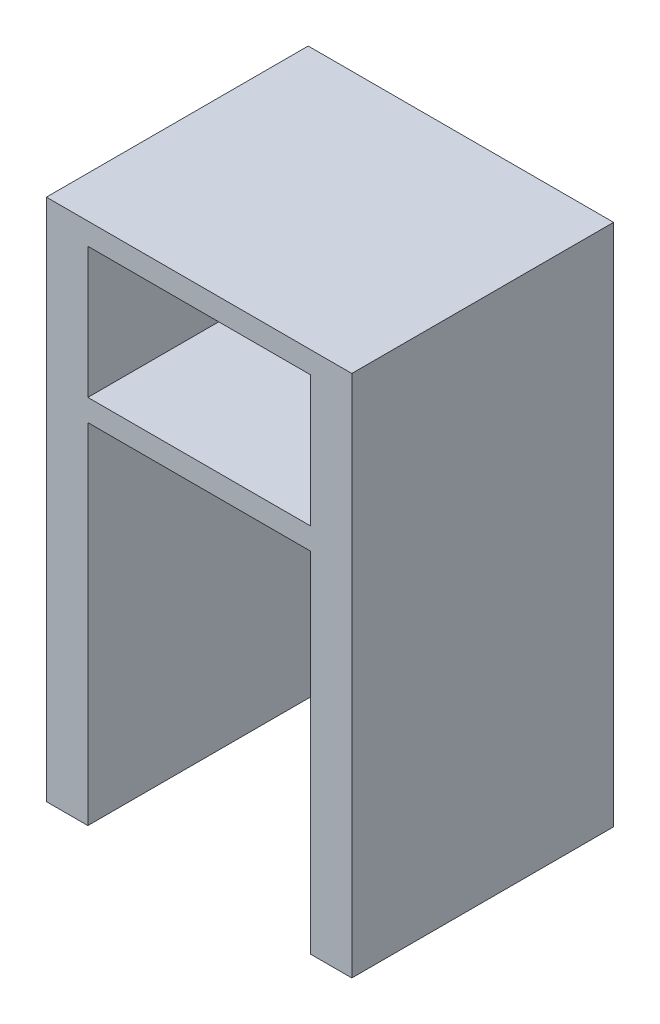
ISO-10303-21;
HEADER;
FILE_DESCRIPTION(('STEP AP214'),'2;1');
FILE_NAME('part.step','',(''),(''),'','','');
FILE_SCHEMA(('AUTOMOTIVE_DESIGN { 1 0 10303 214 1 1 1 1 }'));
ENDSEC;
DATA;
#1=APPLICATION_CONTEXT('core data for automotive mechanical design processes');
#2=APPLICATION_PROTOCOL_DEFINITION('international standard','automotive_design',2000,#1);
#3=PRODUCT_CONTEXT('',#1,'mechanical');
#4=PRODUCT('Part','Part','',(#3));
#5=PRODUCT_RELATED_PRODUCT_CATEGORY('part','',(#4));
#6=PRODUCT_DEFINITION_FORMATION('','',#4);
#7=PRODUCT_DEFINITION_CONTEXT('part definition',#1,'design');
#8=PRODUCT_DEFINITION('design','',#6,#7);
#9=PRODUCT_DEFINITION_SHAPE('','',#8);
#10=(LENGTH_UNIT() NAMED_UNIT(*) SI_UNIT(.MILLI.,.METRE.));
#11=(NAMED_UNIT(*) PLANE_ANGLE_UNIT() SI_UNIT($,.RADIAN.));
#12=(NAMED_UNIT(*) SI_UNIT($,.STERADIAN.) SOLID_ANGLE_UNIT());
#13=UNCERTAINTY_MEASURE_WITH_UNIT(LENGTH_MEASURE(1.E-05),#10,'distance_accuracy_value','');
#14=(GEOMETRIC_REPRESENTATION_CONTEXT(3) GLOBAL_UNCERTAINTY_ASSIGNED_CONTEXT((#13)) GLOBAL_UNIT_ASSIGNED_CONTEXT((#10,
#11,#12)) REPRESENTATION_CONTEXT('',''));
#15=CARTESIAN_POINT('',(0.,0.,0.));
#16=DIRECTION('',(0.,0.,1.));
#17=DIRECTION('',(1.,0.,0.));
#18=AXIS2_PLACEMENT_3D('',#15,#16,#17);
#19=CARTESIAN_POINT('',(-70.,-120.,120.));
#20=DIRECTION('',(0.,1.,0.));
#21=DIRECTION('',(0.,0.,1.));
#22=AXIS2_PLACEMENT_3D('',#19,#20,#21);
#23=PLANE('',#22);
#24=DIRECTION('',(1.,0.,0.));
#25=VECTOR('',#24,1.);
#26=CARTESIAN_POINT('',(-70.,-120.,0.));
#27=LINE('',#26,#25);
#28=CARTESIAN_POINT('',(-70.,-120.,0.));
#29=VERTEX_POINT('',#28);
#30=CARTESIAN_POINT('',(-51.,-120.,0.));
#31=VERTEX_POINT('',#30);
#32=EDGE_CURVE('E146',#29,#31,#27,.T.);
#33=ORIENTED_EDGE('',*,*,#32,.T.);
#34=DIRECTION('',(0.,0.,1.));
#35=VECTOR('',#34,1.);
#36=CARTESIAN_POINT('',(-51.,-120.,0.));
#37=LINE('',#36,#35);
#38=CARTESIAN_POINT('',(-51.,-120.,120.));
#39=VERTEX_POINT('',#38);
#40=EDGE_CURVE('E129',#31,#39,#37,.T.);
#41=ORIENTED_EDGE('',*,*,#40,.T.);
#42=DIRECTION('',(1.,0.,0.));
#43=VECTOR('',#42,1.);
#44=CARTESIAN_POINT('',(-70.,-120.,120.));
#45=LINE('',#44,#43);
#46=CARTESIAN_POINT('',(-70.,-120.,120.));
#47=VERTEX_POINT('',#46);
#48=EDGE_CURVE('E172',#47,#39,#45,.T.);
#49=ORIENTED_EDGE('',*,*,#48,.F.);
#50=DIRECTION('',(0.,0.,-1.));
#51=VECTOR('',#50,1.);
#52=CARTESIAN_POINT('',(-70.,-120.,120.));
#53=LINE('',#52,#51);
#54=EDGE_CURVE('E154',#47,#29,#53,.T.);
#55=ORIENTED_EDGE('',*,*,#54,.T.);
#56=EDGE_LOOP('',(#33,#41,#49,#55));
#57=FACE_BOUND('',#56,.T.);
#58=ADVANCED_FACE('F39',(#57),#23,.F.);
#59=CARTESIAN_POINT('',(70.,120.,120.));
#60=DIRECTION('',(-1.,0.,0.));
#61=DIRECTION('',(0.,-1.,0.));
#62=AXIS2_PLACEMENT_3D('',#59,#60,#61);
#63=PLANE('',#62);
#64=DIRECTION('',(0.,1.,0.));
#65=VECTOR('',#64,1.);
#66=CARTESIAN_POINT('',(70.,120.,0.));
#67=LINE('',#66,#65);
#68=CARTESIAN_POINT('',(70.,-120.,0.));
#69=VERTEX_POINT('',#68);
#70=CARTESIAN_POINT('',(70.,120.,0.));
#71=VERTEX_POINT('',#70);
#72=EDGE_CURVE('E186',#69,#71,#67,.T.);
#73=ORIENTED_EDGE('',*,*,#72,.T.);
#74=DIRECTION('',(0.,0.,-1.));
#75=VECTOR('',#74,1.);
#76=CARTESIAN_POINT('',(70.,120.,120.));
#77=LINE('',#76,#75);
#78=CARTESIAN_POINT('',(70.,120.,120.));
#79=VERTEX_POINT('',#78);
#80=EDGE_CURVE('E11',#79,#71,#77,.T.);
#81=ORIENTED_EDGE('',*,*,#80,.F.);
#82=DIRECTION('',(0.,1.,0.));
#83=VECTOR('',#82,1.);
#84=CARTESIAN_POINT('',(70.,120.,120.));
#85=LINE('',#84,#83);
#86=CARTESIAN_POINT('',(70.,-120.,120.));
#87=VERTEX_POINT('',#86);
#88=EDGE_CURVE('E156',#87,#79,#85,.T.);
#89=ORIENTED_EDGE('',*,*,#88,.F.);
#90=DIRECTION('',(0.,0.,-1.));
#91=VECTOR('',#90,1.);
#92=CARTESIAN_POINT('',(70.,-120.,120.));
#93=LINE('',#92,#91);
#94=EDGE_CURVE('E168',#87,#69,#93,.T.);
#95=ORIENTED_EDGE('',*,*,#94,.T.);
#96=EDGE_LOOP('',(#73,#81,#89,#95));
#97=FACE_BOUND('',#96,.T.);
#98=ADVANCED_FACE('F41',(#97),#63,.F.);
#99=CARTESIAN_POINT('',(-70.,120.,120.));
#100=DIRECTION('',(0.,-1.,0.));
#101=DIRECTION('',(0.,0.,-1.));
#102=AXIS2_PLACEMENT_3D('',#99,#100,#101);
#103=PLANE('',#102);
#104=DIRECTION('',(-1.,0.,0.));
#105=VECTOR('',#104,1.);
#106=CARTESIAN_POINT('',(-70.,120.,0.));
#107=LINE('',#106,#105);
#108=CARTESIAN_POINT('',(-70.,120.,0.));
#109=VERTEX_POINT('',#108);
#110=EDGE_CURVE('E183',#71,#109,#107,.T.);
#111=ORIENTED_EDGE('',*,*,#110,.T.);
#112=DIRECTION('',(0.,0.,-1.));
#113=VECTOR('',#112,1.);
#114=CARTESIAN_POINT('',(-70.,120.,120.));
#115=LINE('',#114,#113);
#116=CARTESIAN_POINT('',(-70.,120.,120.));
#117=VERTEX_POINT('',#116);
#118=EDGE_CURVE('E48',#117,#109,#115,.T.);
#119=ORIENTED_EDGE('',*,*,#118,.F.);
#120=DIRECTION('',(-1.,0.,0.));
#121=VECTOR('',#120,1.);
#122=CARTESIAN_POINT('',(-70.,120.,120.));
#123=LINE('',#122,#121);
#124=EDGE_CURVE('E162',#79,#117,#123,.T.);
#125=ORIENTED_EDGE('',*,*,#124,.F.);
#126=ORIENTED_EDGE('',*,*,#80,.T.);
#127=EDGE_LOOP('',(#111,#119,#125,#126));
#128=FACE_BOUND('',#127,.T.);
#129=ADVANCED_FACE('F291',(#128),#103,.F.);
#130=CARTESIAN_POINT('',(-70.,120.,120.));
#131=DIRECTION('',(1.,0.,0.));
#132=DIRECTION('',(0.,1.,0.));
#133=AXIS2_PLACEMENT_3D('',#130,#131,#132);
#134=PLANE('',#133);
#135=DIRECTION('',(0.,-1.,0.));
#136=VECTOR('',#135,1.);
#137=CARTESIAN_POINT('',(-70.,120.,0.));
#138=LINE('',#137,#136);
#139=EDGE_CURVE('E164',#109,#29,#138,.T.);
#140=ORIENTED_EDGE('',*,*,#139,.T.);
#141=ORIENTED_EDGE('',*,*,#54,.F.);
#142=DIRECTION('',(0.,-1.,0.));
#143=VECTOR('',#142,1.);
#144=CARTESIAN_POINT('',(-70.,120.,120.));
#145=LINE('',#144,#143);
#146=EDGE_CURVE('E180',#117,#47,#145,.T.);
#147=ORIENTED_EDGE('',*,*,#146,.F.);
#148=ORIENTED_EDGE('',*,*,#118,.T.);
#149=EDGE_LOOP('',(#140,#141,#147,#148));
#150=FACE_BOUND('',#149,.T.);
#151=ADVANCED_FACE('F179',(#150),#134,.F.);
#152=CARTESIAN_POINT('',(51.,-120.,120.));
#153=VERTEX_POINT('',#152);
#154=EDGE_CURVE('E194',#153,#87,#45,.T.);
#155=ORIENTED_EDGE('',*,*,#154,.F.);
#156=DIRECTION('',(0.,0.,1.));
#157=VECTOR('',#156,1.);
#158=CARTESIAN_POINT('',(51.,-120.,0.));
#159=LINE('',#158,#157);
#160=CARTESIAN_POINT('',(51.,-120.,0.));
#161=VERTEX_POINT('',#160);
#162=EDGE_CURVE('E140',#161,#153,#159,.T.);
#163=ORIENTED_EDGE('',*,*,#162,.F.);
#164=EDGE_CURVE('E157',#161,#69,#27,.T.);
#165=ORIENTED_EDGE('',*,*,#164,.T.);
#166=ORIENTED_EDGE('',*,*,#94,.F.);
#167=EDGE_LOOP('',(#155,#163,#165,#166));
#168=FACE_BOUND('',#167,.T.);
#169=ADVANCED_FACE('F267',(#168),#23,.F.);
#170=CARTESIAN_POINT('',(0.,0.,120.));
#171=DIRECTION('',(0.,0.,1.));
#172=DIRECTION('',(1.,0.,0.));
#173=AXIS2_PLACEMENT_3D('',#170,#171,#172);
#174=PLANE('',#173);
#175=DIRECTION('',(0.,-1.,0.));
#176=VECTOR('',#175,1.);
#177=CARTESIAN_POINT('',(-51.,40.,120.));
#178=LINE('',#177,#176);
#179=CARTESIAN_POINT('',(-51.,40.,120.));
#180=VERTEX_POINT('',#179);
#181=EDGE_CURVE('E134',#180,#39,#178,.T.);
#182=ORIENTED_EDGE('',*,*,#181,.F.);
#183=DIRECTION('',(-1.,0.,0.));
#184=VECTOR('',#183,1.);
#185=CARTESIAN_POINT('',(-51.,40.,120.));
#186=LINE('',#185,#184);
#187=CARTESIAN_POINT('',(51.,40.,120.));
#188=VERTEX_POINT('',#187);
#189=EDGE_CURVE('E150',#188,#180,#186,.T.);
#190=ORIENTED_EDGE('',*,*,#189,.F.);
#191=DIRECTION('',(0.,1.,0.));
#192=VECTOR('',#191,1.);
#193=CARTESIAN_POINT('',(51.,40.,120.));
#194=LINE('',#193,#192);
#195=EDGE_CURVE('E251',#153,#188,#194,.T.);
#196=ORIENTED_EDGE('',*,*,#195,.F.);
#197=ORIENTED_EDGE('',*,*,#154,.T.);
#198=ORIENTED_EDGE('',*,*,#88,.T.);
#199=ORIENTED_EDGE('',*,*,#124,.T.);
#200=ORIENTED_EDGE('',*,*,#146,.T.);
#201=ORIENTED_EDGE('',*,*,#48,.T.);
#202=EDGE_LOOP('',(#182,#190,#196,#197,#198,#199,#200,#201));
#203=FACE_BOUND('',#202,.T.);
#204=DIRECTION('',(0.,-1.,0.));
#205=VECTOR('',#204,1.);
#206=CARTESIAN_POINT('',(-51.,110.,120.));
#207=LINE('',#206,#205);
#208=CARTESIAN_POINT('',(-51.,110.,120.));
#209=VERTEX_POINT('',#208);
#210=CARTESIAN_POINT('',(-51.,50.,120.));
#211=VERTEX_POINT('',#210);
#212=EDGE_CURVE('E55',#209,#211,#207,.T.);
#213=ORIENTED_EDGE('',*,*,#212,.F.);
#214=DIRECTION('',(-1.,0.,0.));
#215=VECTOR('',#214,1.);
#216=CARTESIAN_POINT('',(-51.,110.,120.));
#217=LINE('',#216,#215);
#218=CARTESIAN_POINT('',(51.,110.,120.));
#219=VERTEX_POINT('',#218);
#220=EDGE_CURVE('E212',#219,#209,#217,.T.);
#221=ORIENTED_EDGE('',*,*,#220,.F.);
#222=DIRECTION('',(0.,1.,0.));
#223=VECTOR('',#222,1.);
#224=CARTESIAN_POINT('',(51.,110.,120.));
#225=LINE('',#224,#223);
#226=CARTESIAN_POINT('',(51.,50.,120.));
#227=VERTEX_POINT('',#226);
#228=EDGE_CURVE('E217',#227,#219,#225,.T.);
#229=ORIENTED_EDGE('',*,*,#228,.F.);
#230=DIRECTION('',(1.,0.,0.));
#231=VECTOR('',#230,1.);
#232=CARTESIAN_POINT('',(-51.,50.,120.));
#233=LINE('',#232,#231);
#234=EDGE_CURVE('E221',#211,#227,#233,.T.);
#235=ORIENTED_EDGE('',*,*,#234,.F.);
#236=EDGE_LOOP('',(#213,#221,#229,#235));
#237=FACE_BOUND('',#236,.T.);
#238=ADVANCED_FACE('F272',(#203,#237),#174,.T.);
#239=CARTESIAN_POINT('',(0.,0.,0.));
#240=DIRECTION('',(0.,0.,1.));
#241=DIRECTION('',(1.,0.,0.));
#242=AXIS2_PLACEMENT_3D('',#239,#240,#241);
#243=PLANE('',#242);
#244=DIRECTION('',(-1.,0.,0.));
#245=VECTOR('',#244,1.);
#246=CARTESIAN_POINT('',(-51.,110.,0.));
#247=LINE('',#246,#245);
#248=CARTESIAN_POINT('',(51.,110.,0.));
#249=VERTEX_POINT('',#248);
#250=CARTESIAN_POINT('',(-51.,110.,0.));
#251=VERTEX_POINT('',#250);
#252=EDGE_CURVE('E203',#249,#251,#247,.T.);
#253=ORIENTED_EDGE('',*,*,#252,.T.);
#254=DIRECTION('',(0.,-1.,0.));
#255=VECTOR('',#254,1.);
#256=CARTESIAN_POINT('',(-51.,110.,0.));
#257=LINE('',#256,#255);
#258=CARTESIAN_POINT('',(-51.,50.,0.));
#259=VERTEX_POINT('',#258);
#260=EDGE_CURVE('E216',#251,#259,#257,.T.);
#261=ORIENTED_EDGE('',*,*,#260,.T.);
#262=DIRECTION('',(1.,0.,0.));
#263=VECTOR('',#262,1.);
#264=CARTESIAN_POINT('',(-51.,50.,0.));
#265=LINE('',#264,#263);
#266=CARTESIAN_POINT('',(51.,50.,0.));
#267=VERTEX_POINT('',#266);
#268=EDGE_CURVE('E234',#259,#267,#265,.T.);
#269=ORIENTED_EDGE('',*,*,#268,.T.);
#270=DIRECTION('',(0.,1.,0.));
#271=VECTOR('',#270,1.);
#272=CARTESIAN_POINT('',(51.,110.,0.));
#273=LINE('',#272,#271);
#274=EDGE_CURVE('E230',#267,#249,#273,.T.);
#275=ORIENTED_EDGE('',*,*,#274,.T.);
#276=EDGE_LOOP('',(#253,#261,#269,#275));
#277=FACE_BOUND('',#276,.T.);
#278=DIRECTION('',(-1.,0.,0.));
#279=VECTOR('',#278,1.);
#280=CARTESIAN_POINT('',(-51.,40.,0.));
#281=LINE('',#280,#279);
#282=CARTESIAN_POINT('',(51.,40.,0.));
#283=VERTEX_POINT('',#282);
#284=CARTESIAN_POINT('',(-51.,40.,0.));
#285=VERTEX_POINT('',#284);
#286=EDGE_CURVE('E63',#283,#285,#281,.T.);
#287=ORIENTED_EDGE('',*,*,#286,.T.);
#288=DIRECTION('',(0.,-1.,0.));
#289=VECTOR('',#288,1.);
#290=CARTESIAN_POINT('',(-51.,40.,0.));
#291=LINE('',#290,#289);
#292=EDGE_CURVE('E132',#285,#31,#291,.T.);
#293=ORIENTED_EDGE('',*,*,#292,.T.);
#294=ORIENTED_EDGE('',*,*,#32,.F.);
#295=ORIENTED_EDGE('',*,*,#139,.F.);
#296=ORIENTED_EDGE('',*,*,#110,.F.);
#297=ORIENTED_EDGE('',*,*,#72,.F.);
#298=ORIENTED_EDGE('',*,*,#164,.F.);
#299=DIRECTION('',(0.,1.,0.));
#300=VECTOR('',#299,1.);
#301=CARTESIAN_POINT('',(51.,40.,0.));
#302=LINE('',#301,#300);
#303=EDGE_CURVE('E149',#161,#283,#302,.T.);
#304=ORIENTED_EDGE('',*,*,#303,.T.);
#305=EDGE_LOOP('',(#287,#293,#294,#295,#296,#297,#298,#304));
#306=FACE_BOUND('',#305,.T.);
#307=ADVANCED_FACE('F144',(#277,#306),#243,.F.);
#308=CARTESIAN_POINT('',(-51.,110.,0.));
#309=DIRECTION('',(-1.,0.,0.));
#310=DIRECTION('',(0.,-1.,0.));
#311=AXIS2_PLACEMENT_3D('',#308,#309,#310);
#312=PLANE('',#311);
#313=ORIENTED_EDGE('',*,*,#212,.T.);
#314=DIRECTION('',(0.,0.,1.));
#315=VECTOR('',#314,1.);
#316=CARTESIAN_POINT('',(-51.,50.,0.));
#317=LINE('',#316,#315);
#318=EDGE_CURVE('E199',#259,#211,#317,.T.);
#319=ORIENTED_EDGE('',*,*,#318,.F.);
#320=ORIENTED_EDGE('',*,*,#260,.F.);
#321=DIRECTION('',(0.,0.,1.));
#322=VECTOR('',#321,1.);
#323=CARTESIAN_POINT('',(-51.,110.,0.));
#324=LINE('',#323,#322);
#325=EDGE_CURVE('E209',#251,#209,#324,.T.);
#326=ORIENTED_EDGE('',*,*,#325,.T.);
#327=EDGE_LOOP('',(#313,#319,#320,#326));
#328=FACE_BOUND('',#327,.T.);
#329=ADVANCED_FACE('F335',(#328),#312,.F.);
#330=CARTESIAN_POINT('',(-51.,110.,0.));
#331=DIRECTION('',(0.,1.,0.));
#332=DIRECTION('',(0.,0.,1.));
#333=AXIS2_PLACEMENT_3D('',#330,#331,#332);
#334=PLANE('',#333);
#335=ORIENTED_EDGE('',*,*,#220,.T.);
#336=ORIENTED_EDGE('',*,*,#325,.F.);
#337=ORIENTED_EDGE('',*,*,#252,.F.);
#338=DIRECTION('',(0.,0.,1.));
#339=VECTOR('',#338,1.);
#340=CARTESIAN_POINT('',(51.,110.,0.));
#341=LINE('',#340,#339);
#342=EDGE_CURVE('E206',#249,#219,#341,.T.);
#343=ORIENTED_EDGE('',*,*,#342,.T.);
#344=EDGE_LOOP('',(#335,#336,#337,#343));
#345=FACE_BOUND('',#344,.T.);
#346=ADVANCED_FACE('F347',(#345),#334,.F.);
#347=CARTESIAN_POINT('',(51.,110.,0.));
#348=DIRECTION('',(1.,0.,0.));
#349=DIRECTION('',(0.,1.,0.));
#350=AXIS2_PLACEMENT_3D('',#347,#348,#349);
#351=PLANE('',#350);
#352=ORIENTED_EDGE('',*,*,#228,.T.);
#353=ORIENTED_EDGE('',*,*,#342,.F.);
#354=ORIENTED_EDGE('',*,*,#274,.F.);
#355=DIRECTION('',(0.,0.,1.));
#356=VECTOR('',#355,1.);
#357=CARTESIAN_POINT('',(51.,50.,0.));
#358=LINE('',#357,#356);
#359=EDGE_CURVE('E202',#267,#227,#358,.T.);
#360=ORIENTED_EDGE('',*,*,#359,.T.);
#361=EDGE_LOOP('',(#352,#353,#354,#360));
#362=FACE_BOUND('',#361,.T.);
#363=ADVANCED_FACE('F355',(#362),#351,.F.);
#364=CARTESIAN_POINT('',(-51.,50.,0.));
#365=DIRECTION('',(0.,-1.,0.));
#366=DIRECTION('',(0.,0.,-1.));
#367=AXIS2_PLACEMENT_3D('',#364,#365,#366);
#368=PLANE('',#367);
#369=ORIENTED_EDGE('',*,*,#234,.T.);
#370=ORIENTED_EDGE('',*,*,#359,.F.);
#371=ORIENTED_EDGE('',*,*,#268,.F.);
#372=ORIENTED_EDGE('',*,*,#318,.T.);
#373=EDGE_LOOP('',(#369,#370,#371,#372));
#374=FACE_BOUND('',#373,.T.);
#375=ADVANCED_FACE('F284',(#374),#368,.F.);
#376=CARTESIAN_POINT('',(-51.,40.,0.));
#377=DIRECTION('',(-1.,0.,0.));
#378=DIRECTION('',(0.,-1.,0.));
#379=AXIS2_PLACEMENT_3D('',#376,#377,#378);
#380=PLANE('',#379);
#381=ORIENTED_EDGE('',*,*,#181,.T.);
#382=ORIENTED_EDGE('',*,*,#40,.F.);
#383=ORIENTED_EDGE('',*,*,#292,.F.);
#384=DIRECTION('',(0.,0.,1.));
#385=VECTOR('',#384,1.);
#386=CARTESIAN_POINT('',(-51.,40.,0.));
#387=LINE('',#386,#385);
#388=EDGE_CURVE('E189',#285,#180,#387,.T.);
#389=ORIENTED_EDGE('',*,*,#388,.T.);
#390=EDGE_LOOP('',(#381,#382,#383,#389));
#391=FACE_BOUND('',#390,.T.);
#392=ADVANCED_FACE('F131',(#391),#380,.F.);
#393=CARTESIAN_POINT('',(-51.,40.,0.));
#394=DIRECTION('',(0.,1.,0.));
#395=DIRECTION('',(0.,0.,1.));
#396=AXIS2_PLACEMENT_3D('',#393,#394,#395);
#397=PLANE('',#396);
#398=ORIENTED_EDGE('',*,*,#189,.T.);
#399=ORIENTED_EDGE('',*,*,#388,.F.);
#400=ORIENTED_EDGE('',*,*,#286,.F.);
#401=DIRECTION('',(0.,0.,1.));
#402=VECTOR('',#401,1.);
#403=CARTESIAN_POINT('',(51.,40.,0.));
#404=LINE('',#403,#402);
#405=EDGE_CURVE('E243',#283,#188,#404,.T.);
#406=ORIENTED_EDGE('',*,*,#405,.T.);
#407=EDGE_LOOP('',(#398,#399,#400,#406));
#408=FACE_BOUND('',#407,.T.);
#409=ADVANCED_FACE('F276',(#408),#397,.F.);
#410=CARTESIAN_POINT('',(51.,40.,0.));
#411=DIRECTION('',(1.,0.,0.));
#412=DIRECTION('',(0.,1.,0.));
#413=AXIS2_PLACEMENT_3D('',#410,#411,#412);
#414=PLANE('',#413);
#415=ORIENTED_EDGE('',*,*,#195,.T.);
#416=ORIENTED_EDGE('',*,*,#405,.F.);
#417=ORIENTED_EDGE('',*,*,#303,.F.);
#418=ORIENTED_EDGE('',*,*,#162,.T.);
#419=EDGE_LOOP('',(#415,#416,#417,#418));
#420=FACE_BOUND('',#419,.T.);
#421=ADVANCED_FACE('F263',(#420),#414,.F.);
#422=CLOSED_SHELL('',(#58,#98,#129,#151,#169,#238,#307,#329,#346,#363,#375,#392,#409,#421));
#423=MANIFOLD_SOLID_BREP('B2',#422);
#424=ADVANCED_BREP_SHAPE_REPRESENTATION('',(#18,#423),#14);
#425=SHAPE_DEFINITION_REPRESENTATION(#9,#424);
ENDSEC;
END-ISO-10303-21;
